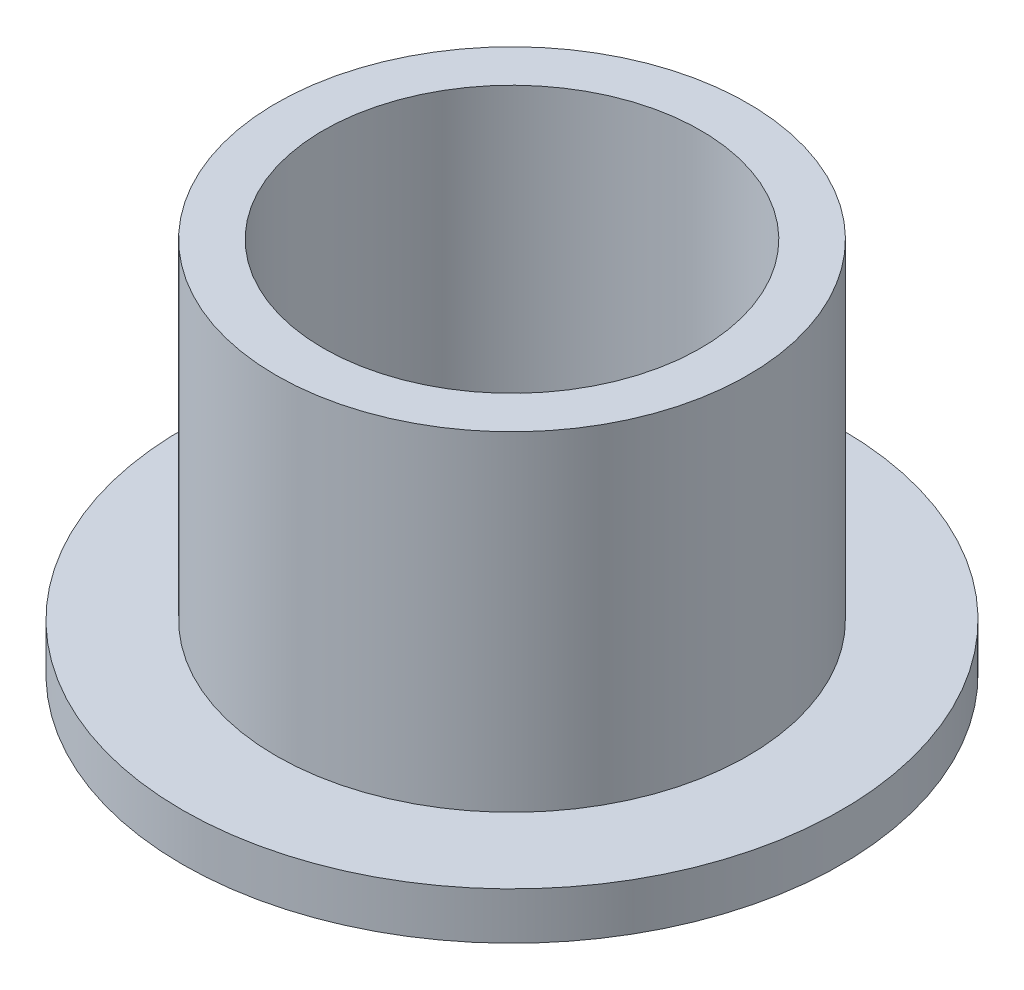
ISO-10303-21;
HEADER;
FILE_DESCRIPTION(('STEP AP214'),'2;1');
FILE_NAME('part.step','',(''),(''),'','','');
FILE_SCHEMA(('AUTOMOTIVE_DESIGN { 1 0 10303 214 1 1 1 1 }'));
ENDSEC;
DATA;
#1=APPLICATION_CONTEXT('core data for automotive mechanical design processes');
#2=APPLICATION_PROTOCOL_DEFINITION('international standard','automotive_design',2000,#1);
#3=PRODUCT_CONTEXT('',#1,'mechanical');
#4=PRODUCT('Part','Part','',(#3));
#5=PRODUCT_RELATED_PRODUCT_CATEGORY('part','',(#4));
#6=PRODUCT_DEFINITION_FORMATION('','',#4);
#7=PRODUCT_DEFINITION_CONTEXT('part definition',#1,'design');
#8=PRODUCT_DEFINITION('design','',#6,#7);
#9=PRODUCT_DEFINITION_SHAPE('','',#8);
#10=(LENGTH_UNIT() NAMED_UNIT(*) SI_UNIT(.MILLI.,.METRE.));
#11=(NAMED_UNIT(*) PLANE_ANGLE_UNIT() SI_UNIT($,.RADIAN.));
#12=(NAMED_UNIT(*) SI_UNIT($,.STERADIAN.) SOLID_ANGLE_UNIT());
#13=UNCERTAINTY_MEASURE_WITH_UNIT(LENGTH_MEASURE(1.E-05),#10,'distance_accuracy_value','');
#14=(GEOMETRIC_REPRESENTATION_CONTEXT(3) GLOBAL_UNCERTAINTY_ASSIGNED_CONTEXT((#13)) GLOBAL_UNIT_ASSIGNED_CONTEXT((#10,
#11,#12)) REPRESENTATION_CONTEXT('',''));
#15=CARTESIAN_POINT('',(0.,0.,0.));
#16=DIRECTION('',(0.,0.,1.));
#17=DIRECTION('',(1.,0.,0.));
#18=AXIS2_PLACEMENT_3D('',#15,#16,#17);
#19=CARTESIAN_POINT('',(0.,12.7,0.));
#20=DIRECTION('',(0.,1.,0.));
#21=DIRECTION('',(0.,0.,1.));
#22=AXIS2_PLACEMENT_3D('',#19,#20,#21);
#23=PLANE('',#22);
#24=CARTESIAN_POINT('',(0.,12.7,0.));
#25=DIRECTION('',(0.,1.,0.));
#26=DIRECTION('',(0.,0.,1.));
#27=AXIS2_PLACEMENT_3D('',#24,#25,#26);
#28=CIRCLE('',#27,7.9502);
#29=CARTESIAN_POINT('',(0.,12.7,7.9502));
#30=VERTEX_POINT('',#29);
#31=EDGE_CURVE('E10',#30,#30,#28,.T.);
#32=ORIENTED_EDGE('',*,*,#31,.T.);
#33=EDGE_LOOP('',(#32));
#34=FACE_BOUND('',#33,.T.);
#35=CARTESIAN_POINT('',(0.,12.7,0.));
#36=DIRECTION('',(0.,1.,0.));
#37=DIRECTION('',(0.,0.,1.));
#38=AXIS2_PLACEMENT_3D('',#35,#36,#37);
#39=CIRCLE('',#38,6.3627);
#40=CARTESIAN_POINT('',(0.,12.7,6.3627));
#41=VERTEX_POINT('',#40);
#42=EDGE_CURVE('E38',#41,#41,#39,.T.);
#43=ORIENTED_EDGE('',*,*,#42,.F.);
#44=EDGE_LOOP('',(#43));
#45=FACE_BOUND('',#44,.T.);
#46=ADVANCED_FACE('F31',(#34,#45),#23,.T.);
#47=CARTESIAN_POINT('',(0.,0.,0.));
#48=DIRECTION('',(0.,1.,0.));
#49=DIRECTION('',(0.,0.,1.));
#50=AXIS2_PLACEMENT_3D('',#47,#48,#49);
#51=PLANE('',#50);
#52=CARTESIAN_POINT('',(0.,0.,0.));
#53=DIRECTION('',(0.,1.,0.));
#54=DIRECTION('',(0.,0.,1.));
#55=AXIS2_PLACEMENT_3D('',#52,#53,#54);
#56=CIRCLE('',#55,6.3627);
#57=CARTESIAN_POINT('',(0.,0.,6.3627));
#58=VERTEX_POINT('',#57);
#59=EDGE_CURVE('E42',#58,#58,#56,.T.);
#60=ORIENTED_EDGE('',*,*,#59,.T.);
#61=EDGE_LOOP('',(#60));
#62=FACE_BOUND('',#61,.T.);
#63=CARTESIAN_POINT('',(0.,0.,0.));
#64=DIRECTION('',(0.,1.,0.));
#65=DIRECTION('',(0.,0.,1.));
#66=AXIS2_PLACEMENT_3D('',#63,#64,#65);
#67=CIRCLE('',#66,11.1125);
#68=CARTESIAN_POINT('',(0.,0.,11.1125));
#69=VERTEX_POINT('',#68);
#70=EDGE_CURVE('E49',#69,#69,#67,.T.);
#71=ORIENTED_EDGE('',*,*,#70,.F.);
#72=EDGE_LOOP('',(#71));
#73=FACE_BOUND('',#72,.T.);
#74=ADVANCED_FACE('F74',(#62,#73),#51,.F.);
#75=CARTESIAN_POINT('',(0.,12.7,0.));
#76=DIRECTION('',(0.,-1.,0.));
#77=DIRECTION('',(0.,0.,-1.));
#78=AXIS2_PLACEMENT_3D('',#75,#76,#77);
#79=CYLINDRICAL_SURFACE('',#78,7.9502);
#80=CARTESIAN_POINT('',(0.,1.5875,0.));
#81=DIRECTION('',(0.,1.,0.));
#82=DIRECTION('',(0.,0.,1.));
#83=AXIS2_PLACEMENT_3D('',#80,#81,#82);
#84=CIRCLE('',#83,7.9502);
#85=CARTESIAN_POINT('',(0.,1.5875,7.9502));
#86=VERTEX_POINT('',#85);
#87=EDGE_CURVE('E52',#86,#86,#84,.T.);
#88=ORIENTED_EDGE('',*,*,#87,.T.);
#89=EDGE_LOOP('',(#88));
#90=FACE_BOUND('',#89,.T.);
#91=ORIENTED_EDGE('',*,*,#31,.F.);
#92=EDGE_LOOP('',(#91));
#93=FACE_BOUND('',#92,.T.);
#94=ADVANCED_FACE('F33',(#90,#93),#79,.T.);
#95=CARTESIAN_POINT('',(0.,12.7,0.));
#96=DIRECTION('',(0.,-1.,0.));
#97=DIRECTION('',(0.,0.,-1.));
#98=AXIS2_PLACEMENT_3D('',#95,#96,#97);
#99=CYLINDRICAL_SURFACE('',#98,6.3627);
#100=ORIENTED_EDGE('',*,*,#42,.T.);
#101=EDGE_LOOP('',(#100));
#102=FACE_BOUND('',#101,.T.);
#103=ORIENTED_EDGE('',*,*,#59,.F.);
#104=EDGE_LOOP('',(#103));
#105=FACE_BOUND('',#104,.T.);
#106=ADVANCED_FACE('F63',(#102,#105),#99,.F.);
#107=CARTESIAN_POINT('',(0.,1.5875,0.));
#108=DIRECTION('',(0.,1.,0.));
#109=DIRECTION('',(0.,0.,1.));
#110=AXIS2_PLACEMENT_3D('',#107,#108,#109);
#111=PLANE('',#110);
#112=CARTESIAN_POINT('',(0.,1.5875,0.));
#113=DIRECTION('',(0.,1.,0.));
#114=DIRECTION('',(0.,0.,1.));
#115=AXIS2_PLACEMENT_3D('',#112,#113,#114);
#116=CIRCLE('',#115,11.1125);
#117=CARTESIAN_POINT('',(0.,1.5875,11.1125));
#118=VERTEX_POINT('',#117);
#119=EDGE_CURVE('E47',#118,#118,#116,.T.);
#120=ORIENTED_EDGE('',*,*,#119,.T.);
#121=EDGE_LOOP('',(#120));
#122=FACE_BOUND('',#121,.T.);
#123=ORIENTED_EDGE('',*,*,#87,.F.);
#124=EDGE_LOOP('',(#123));
#125=FACE_BOUND('',#124,.T.);
#126=ADVANCED_FACE('F60',(#122,#125),#111,.T.);
#127=CARTESIAN_POINT('',(0.,1.5875,0.));
#128=DIRECTION('',(0.,-1.,0.));
#129=DIRECTION('',(0.,0.,-1.));
#130=AXIS2_PLACEMENT_3D('',#127,#128,#129);
#131=CYLINDRICAL_SURFACE('',#130,11.1125);
#132=ORIENTED_EDGE('',*,*,#119,.F.);
#133=EDGE_LOOP('',(#132));
#134=FACE_BOUND('',#133,.T.);
#135=ORIENTED_EDGE('',*,*,#70,.T.);
#136=EDGE_LOOP('',(#135));
#137=FACE_BOUND('',#136,.T.);
#138=ADVANCED_FACE('F62',(#134,#137),#131,.T.);
#139=CLOSED_SHELL('',(#46,#74,#94,#106,#126,#138));
#140=MANIFOLD_SOLID_BREP('B2',#139);
#141=ADVANCED_BREP_SHAPE_REPRESENTATION('',(#18,#140),#14);
#142=SHAPE_DEFINITION_REPRESENTATION(#9,#141);
ENDSEC;
END-ISO-10303-21;
